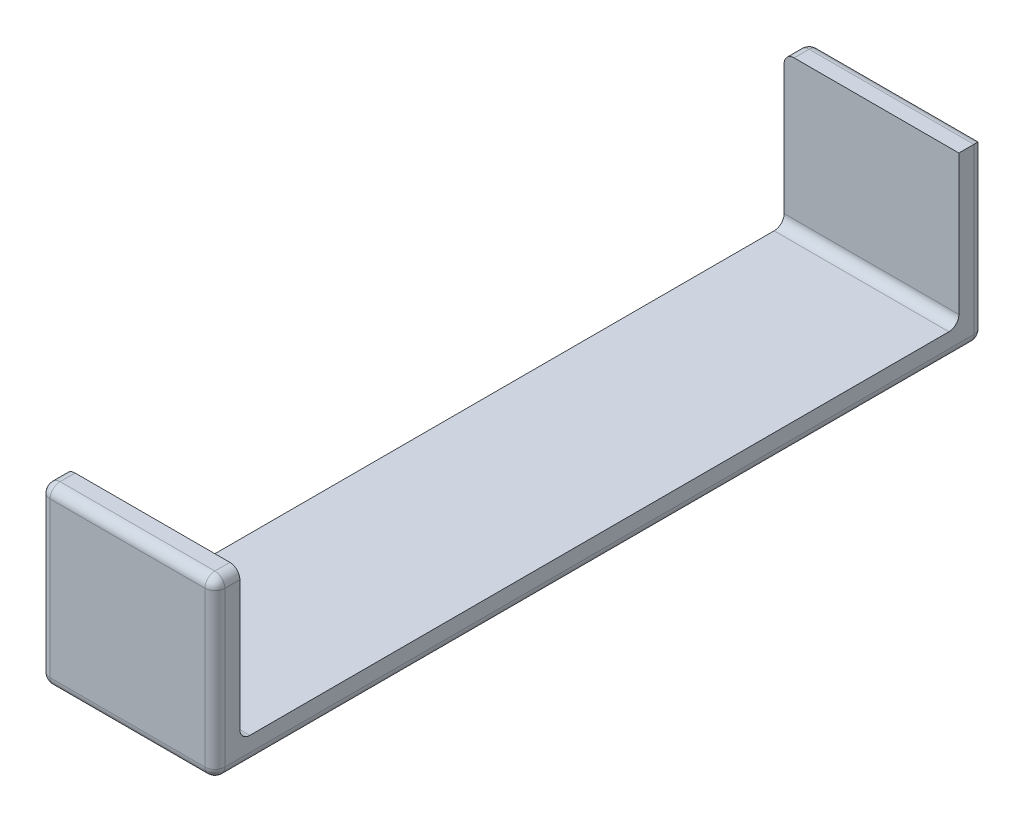
ISO-10303-21;
HEADER;
FILE_DESCRIPTION(('STEP AP214'),'2;1');
FILE_NAME('part.step','',(''),(''),'','','');
FILE_SCHEMA(('AUTOMOTIVE_DESIGN { 1 0 10303 214 1 1 1 1 }'));
ENDSEC;
DATA;
#1=APPLICATION_CONTEXT('core data for automotive mechanical design processes');
#2=APPLICATION_PROTOCOL_DEFINITION('international standard','automotive_design',2000,#1);
#3=PRODUCT_CONTEXT('',#1,'mechanical');
#4=PRODUCT('Part','Part','',(#3));
#5=PRODUCT_RELATED_PRODUCT_CATEGORY('part','',(#4));
#6=PRODUCT_DEFINITION_FORMATION('','',#4);
#7=PRODUCT_DEFINITION_CONTEXT('part definition',#1,'design');
#8=PRODUCT_DEFINITION('design','',#6,#7);
#9=PRODUCT_DEFINITION_SHAPE('','',#8);
#10=(LENGTH_UNIT() NAMED_UNIT(*) SI_UNIT(.MILLI.,.METRE.));
#11=(NAMED_UNIT(*) PLANE_ANGLE_UNIT() SI_UNIT($,.RADIAN.));
#12=(NAMED_UNIT(*) SI_UNIT($,.STERADIAN.) SOLID_ANGLE_UNIT());
#13=UNCERTAINTY_MEASURE_WITH_UNIT(LENGTH_MEASURE(1.E-05),#10,'distance_accuracy_value','');
#14=(GEOMETRIC_REPRESENTATION_CONTEXT(3) GLOBAL_UNCERTAINTY_ASSIGNED_CONTEXT((#13)) GLOBAL_UNIT_ASSIGNED_CONTEXT((#10,
#11,#12)) REPRESENTATION_CONTEXT('',''));
#15=CARTESIAN_POINT('',(0.,0.,0.));
#16=DIRECTION('',(0.,0.,1.));
#17=DIRECTION('',(1.,0.,0.));
#18=AXIS2_PLACEMENT_3D('',#15,#16,#17);
#19=CARTESIAN_POINT('',(0.,17.5,77.));
#20=DIRECTION('',(0.,1.,0.));
#21=DIRECTION('',(0.,0.,1.));
#22=AXIS2_PLACEMENT_3D('',#19,#20,#21);
#23=PLANE('',#22);
#24=DIRECTION('',(1.,0.,0.));
#25=VECTOR('',#24,1.);
#26=CARTESIAN_POINT('',(0.,17.5,1.));
#27=LINE('',#26,#25);
#28=CARTESIAN_POINT('',(17.5,17.5,1.));
#29=VERTEX_POINT('',#28);
#30=CARTESIAN_POINT('',(1.,17.5,1.));
#31=VERTEX_POINT('',#30);
#32=EDGE_CURVE('E226',#29,#31,#27,.F.);
#33=ORIENTED_EDGE('',*,*,#32,.T.);
#34=DIRECTION('',(0.,0.,-1.));
#35=VECTOR('',#34,1.);
#36=CARTESIAN_POINT('',(1.,17.5,77.));
#37=LINE('',#36,#35);
#38=CARTESIAN_POINT('',(1.,17.5,2.5));
#39=VERTEX_POINT('',#38);
#40=EDGE_CURVE('E183',#31,#39,#37,.F.);
#41=ORIENTED_EDGE('',*,*,#40,.T.);
#42=DIRECTION('',(-1.,0.,0.));
#43=VECTOR('',#42,1.);
#44=CARTESIAN_POINT('',(0.,17.5,2.5));
#45=LINE('',#44,#43);
#46=CARTESIAN_POINT('',(17.5,17.5,2.5));
#47=VERTEX_POINT('',#46);
#48=EDGE_CURVE('E167',#47,#39,#45,.T.);
#49=ORIENTED_EDGE('',*,*,#48,.F.);
#50=DIRECTION('',(0.,0.,-1.));
#51=VECTOR('',#50,1.);
#52=CARTESIAN_POINT('',(17.5,17.5,77.));
#53=LINE('',#52,#51);
#54=EDGE_CURVE('E180',#47,#29,#53,.T.);
#55=ORIENTED_EDGE('',*,*,#54,.T.);
#56=EDGE_LOOP('',(#33,#41,#49,#55));
#57=FACE_BOUND('',#56,.T.);
#58=ADVANCED_FACE('F33',(#57),#23,.T.);
#59=CARTESIAN_POINT('',(17.5,0.,77.));
#60=DIRECTION('',(0.,-1.,0.));
#61=DIRECTION('',(0.,0.,-1.));
#62=AXIS2_PLACEMENT_3D('',#59,#60,#61);
#63=PLANE('',#62);
#64=DIRECTION('',(-1.,0.,0.));
#65=VECTOR('',#64,1.);
#66=CARTESIAN_POINT('',(0.,0.,76.));
#67=LINE('',#66,#65);
#68=CARTESIAN_POINT('',(16.5,0.,76.));
#69=VERTEX_POINT('',#68);
#70=CARTESIAN_POINT('',(1.,0.,76.));
#71=VERTEX_POINT('',#70);
#72=EDGE_CURVE('E50',#69,#71,#67,.T.);
#73=ORIENTED_EDGE('',*,*,#72,.T.);
#74=DIRECTION('',(0.,0.,-1.));
#75=VECTOR('',#74,1.);
#76=CARTESIAN_POINT('',(1.,0.,77.));
#77=LINE('',#76,#75);
#78=CARTESIAN_POINT('',(1.,0.,1.));
#79=VERTEX_POINT('',#78);
#80=EDGE_CURVE('E254',#71,#79,#77,.T.);
#81=ORIENTED_EDGE('',*,*,#80,.T.);
#82=DIRECTION('',(-1.,0.,0.));
#83=VECTOR('',#82,1.);
#84=CARTESIAN_POINT('',(17.5,0.,1.));
#85=LINE('',#84,#83);
#86=CARTESIAN_POINT('',(16.5,0.,1.));
#87=VERTEX_POINT('',#86);
#88=EDGE_CURVE('E250',#79,#87,#85,.F.);
#89=ORIENTED_EDGE('',*,*,#88,.T.);
#90=DIRECTION('',(0.,0.,-1.));
#91=VECTOR('',#90,1.);
#92=CARTESIAN_POINT('',(16.5,0.,77.));
#93=LINE('',#92,#91);
#94=EDGE_CURVE('E55',#87,#69,#93,.F.);
#95=ORIENTED_EDGE('',*,*,#94,.T.);
#96=EDGE_LOOP('',(#73,#81,#89,#95));
#97=FACE_BOUND('',#96,.T.);
#98=ADVANCED_FACE('F406',(#97),#63,.T.);
#99=CARTESIAN_POINT('',(17.5,17.5,77.));
#100=DIRECTION('',(1.,0.,0.));
#101=DIRECTION('',(0.,1.,0.));
#102=AXIS2_PLACEMENT_3D('',#99,#100,#101);
#103=PLANE('',#102);
#104=DIRECTION('',(0.,1.,0.));
#105=VECTOR('',#104,1.);
#106=CARTESIAN_POINT('',(17.5,22.5,74.5));
#107=LINE('',#106,#105);
#108=CARTESIAN_POINT('',(17.5,3.5,74.5));
#109=VERTEX_POINT('',#108);
#110=CARTESIAN_POINT('',(17.5,16.5,74.5));
#111=VERTEX_POINT('',#110);
#112=EDGE_CURVE('E344',#109,#111,#107,.T.);
#113=ORIENTED_EDGE('',*,*,#112,.T.);
#114=DIRECTION('',(0.,0.,-1.));
#115=VECTOR('',#114,1.);
#116=CARTESIAN_POINT('',(17.5,16.5,77.));
#117=LINE('',#116,#115);
#118=CARTESIAN_POINT('',(17.5,16.5,76.));
#119=VERTEX_POINT('',#118);
#120=EDGE_CURVE('E214',#111,#119,#117,.F.);
#121=ORIENTED_EDGE('',*,*,#120,.T.);
#122=DIRECTION('',(0.,-1.,0.));
#123=VECTOR('',#122,1.);
#124=CARTESIAN_POINT('',(17.5,0.,76.));
#125=LINE('',#124,#123);
#126=CARTESIAN_POINT('',(17.5,1.,76.));
#127=VERTEX_POINT('',#126);
#128=EDGE_CURVE('E212',#119,#127,#125,.T.);
#129=ORIENTED_EDGE('',*,*,#128,.T.);
#130=DIRECTION('',(0.,0.,-1.));
#131=VECTOR('',#130,1.);
#132=CARTESIAN_POINT('',(17.5,1.,77.));
#133=LINE('',#132,#131);
#134=CARTESIAN_POINT('',(17.5,1.,1.));
#135=VERTEX_POINT('',#134);
#136=EDGE_CURVE('E210',#127,#135,#133,.T.);
#137=ORIENTED_EDGE('',*,*,#136,.T.);
#138=DIRECTION('',(0.,-1.,0.));
#139=VECTOR('',#138,1.);
#140=CARTESIAN_POINT('',(17.5,17.5,1.));
#141=LINE('',#140,#139);
#142=EDGE_CURVE('E189',#135,#29,#141,.F.);
#143=ORIENTED_EDGE('',*,*,#142,.T.);
#144=ORIENTED_EDGE('',*,*,#54,.F.);
#145=DIRECTION('',(0.,-1.,0.));
#146=VECTOR('',#145,1.);
#147=CARTESIAN_POINT('',(17.5,22.5,2.5));
#148=LINE('',#147,#146);
#149=CARTESIAN_POINT('',(17.5,3.5,2.5));
#150=VERTEX_POINT('',#149);
#151=EDGE_CURVE('E164',#47,#150,#148,.T.);
#152=ORIENTED_EDGE('',*,*,#151,.T.);
#153=CARTESIAN_POINT('',(17.5,3.5,3.5));
#154=DIRECTION('',(1.,0.,0.));
#155=DIRECTION('',(0.,1.,0.));
#156=AXIS2_PLACEMENT_3D('',#153,#154,#155);
#157=CIRCLE('',#156,1.);
#158=CARTESIAN_POINT('',(17.5,2.5,3.5));
#159=VERTEX_POINT('',#158);
#160=EDGE_CURVE('E11',#150,#159,#157,.F.);
#161=ORIENTED_EDGE('',*,*,#160,.T.);
#162=DIRECTION('',(0.,0.,1.));
#163=VECTOR('',#162,1.);
#164=CARTESIAN_POINT('',(17.5,2.5,2.5));
#165=LINE('',#164,#163);
#166=CARTESIAN_POINT('',(17.5,2.5,73.5));
#167=VERTEX_POINT('',#166);
#168=EDGE_CURVE('E175',#159,#167,#165,.T.);
#169=ORIENTED_EDGE('',*,*,#168,.T.);
#170=CARTESIAN_POINT('',(17.5,3.5,73.5));
#171=DIRECTION('',(1.,0.,0.));
#172=DIRECTION('',(0.,1.,0.));
#173=AXIS2_PLACEMENT_3D('',#170,#171,#172);
#174=CIRCLE('',#173,1.);
#175=EDGE_CURVE('E263',#167,#109,#174,.F.);
#176=ORIENTED_EDGE('',*,*,#175,.T.);
#177=EDGE_LOOP('',(#113,#121,#129,#137,#143,#144,#152,#161,#169,#176));
#178=FACE_BOUND('',#177,.T.);
#179=ADVANCED_FACE('F187',(#178),#103,.T.);
#180=DIRECTION('',(1.,0.,0.));
#181=VECTOR('',#180,1.);
#182=CARTESIAN_POINT('',(17.5,17.5,76.));
#183=LINE('',#182,#181);
#184=CARTESIAN_POINT('',(1.,17.5,76.));
#185=VERTEX_POINT('',#184);
#186=CARTESIAN_POINT('',(16.5,17.5,76.));
#187=VERTEX_POINT('',#186);
#188=EDGE_CURVE('E192',#185,#187,#183,.T.);
#189=ORIENTED_EDGE('',*,*,#188,.T.);
#190=DIRECTION('',(0.,0.,-1.));
#191=VECTOR('',#190,1.);
#192=CARTESIAN_POINT('',(16.5,17.5,77.));
#193=LINE('',#192,#191);
#194=CARTESIAN_POINT('',(16.5,17.5,74.5));
#195=VERTEX_POINT('',#194);
#196=EDGE_CURVE('E199',#187,#195,#193,.T.);
#197=ORIENTED_EDGE('',*,*,#196,.T.);
#198=DIRECTION('',(1.,0.,0.));
#199=VECTOR('',#198,1.);
#200=CARTESIAN_POINT('',(0.,17.5,74.5));
#201=LINE('',#200,#199);
#202=CARTESIAN_POINT('',(1.,17.5,74.5));
#203=VERTEX_POINT('',#202);
#204=EDGE_CURVE('E184',#203,#195,#201,.T.);
#205=ORIENTED_EDGE('',*,*,#204,.F.);
#206=DIRECTION('',(0.,0.,-1.));
#207=VECTOR('',#206,1.);
#208=CARTESIAN_POINT('',(1.,17.5,77.));
#209=LINE('',#208,#207);
#210=EDGE_CURVE('E197',#203,#185,#209,.F.);
#211=ORIENTED_EDGE('',*,*,#210,.T.);
#212=EDGE_LOOP('',(#189,#197,#205,#211));
#213=FACE_BOUND('',#212,.T.);
#214=ADVANCED_FACE('F384',(#213),#23,.T.);
#215=CARTESIAN_POINT('',(0.,0.,77.));
#216=DIRECTION('',(-1.,0.,0.));
#217=DIRECTION('',(0.,0.,1.));
#218=AXIS2_PLACEMENT_3D('',#215,#216,#217);
#219=PLANE('',#218);
#220=DIRECTION('',(0.,-1.,0.));
#221=VECTOR('',#220,1.);
#222=CARTESIAN_POINT('',(0.,0.,2.5));
#223=LINE('',#222,#221);
#224=CARTESIAN_POINT('',(0.,16.5,2.5));
#225=VERTEX_POINT('',#224);
#226=CARTESIAN_POINT('',(0.,3.5,2.5));
#227=VERTEX_POINT('',#226);
#228=EDGE_CURVE('E190',#225,#227,#223,.T.);
#229=ORIENTED_EDGE('',*,*,#228,.F.);
#230=DIRECTION('',(0.,0.,-1.));
#231=VECTOR('',#230,1.);
#232=CARTESIAN_POINT('',(0.,16.5,77.));
#233=LINE('',#232,#231);
#234=CARTESIAN_POINT('',(0.,16.5,1.));
#235=VERTEX_POINT('',#234);
#236=EDGE_CURVE('E224',#225,#235,#233,.T.);
#237=ORIENTED_EDGE('',*,*,#236,.T.);
#238=DIRECTION('',(0.,1.,0.));
#239=VECTOR('',#238,1.);
#240=CARTESIAN_POINT('',(0.,0.,1.));
#241=LINE('',#240,#239);
#242=CARTESIAN_POINT('',(0.,1.,1.));
#243=VERTEX_POINT('',#242);
#244=EDGE_CURVE('E218',#235,#243,#241,.F.);
#245=ORIENTED_EDGE('',*,*,#244,.T.);
#246=DIRECTION('',(0.,0.,-1.));
#247=VECTOR('',#246,1.);
#248=CARTESIAN_POINT('',(0.,1.,77.));
#249=LINE('',#248,#247);
#250=CARTESIAN_POINT('',(0.,1.,76.));
#251=VERTEX_POINT('',#250);
#252=EDGE_CURVE('E216',#243,#251,#249,.F.);
#253=ORIENTED_EDGE('',*,*,#252,.T.);
#254=DIRECTION('',(0.,1.,0.));
#255=VECTOR('',#254,1.);
#256=CARTESIAN_POINT('',(0.,17.5,76.));
#257=LINE('',#256,#255);
#258=CARTESIAN_POINT('',(0.,16.5,76.));
#259=VERTEX_POINT('',#258);
#260=EDGE_CURVE('E220',#251,#259,#257,.T.);
#261=ORIENTED_EDGE('',*,*,#260,.T.);
#262=DIRECTION('',(0.,0.,-1.));
#263=VECTOR('',#262,1.);
#264=CARTESIAN_POINT('',(0.,16.5,77.));
#265=LINE('',#264,#263);
#266=CARTESIAN_POINT('',(0.,16.5,74.5));
#267=VERTEX_POINT('',#266);
#268=EDGE_CURVE('E222',#259,#267,#265,.T.);
#269=ORIENTED_EDGE('',*,*,#268,.T.);
#270=DIRECTION('',(0.,1.,0.));
#271=VECTOR('',#270,1.);
#272=CARTESIAN_POINT('',(0.,22.5,74.5));
#273=LINE('',#272,#271);
#274=CARTESIAN_POINT('',(0.,3.5,74.5));
#275=VERTEX_POINT('',#274);
#276=EDGE_CURVE('E176',#275,#267,#273,.T.);
#277=ORIENTED_EDGE('',*,*,#276,.F.);
#278=CARTESIAN_POINT('',(0.,3.5,73.5));
#279=DIRECTION('',(-1.,0.,0.));
#280=DIRECTION('',(0.,0.,1.));
#281=AXIS2_PLACEMENT_3D('',#278,#279,#280);
#282=CIRCLE('',#281,1.);
#283=CARTESIAN_POINT('',(0.,2.5,73.5));
#284=VERTEX_POINT('',#283);
#285=EDGE_CURVE('E261',#275,#284,#282,.F.);
#286=ORIENTED_EDGE('',*,*,#285,.T.);
#287=DIRECTION('',(0.,0.,1.));
#288=VECTOR('',#287,1.);
#289=CARTESIAN_POINT('',(0.,2.5,2.5));
#290=LINE('',#289,#288);
#291=CARTESIAN_POINT('',(0.,2.5,3.5));
#292=VERTEX_POINT('',#291);
#293=EDGE_CURVE('E333',#292,#284,#290,.T.);
#294=ORIENTED_EDGE('',*,*,#293,.F.);
#295=CARTESIAN_POINT('',(0.,3.5,3.5));
#296=DIRECTION('',(-1.,0.,0.));
#297=DIRECTION('',(0.,0.,1.));
#298=AXIS2_PLACEMENT_3D('',#295,#296,#297);
#299=CIRCLE('',#298,1.);
#300=EDGE_CURVE('E42',#292,#227,#299,.F.);
#301=ORIENTED_EDGE('',*,*,#300,.T.);
#302=EDGE_LOOP('',(#229,#237,#245,#253,#261,#269,#277,#286,#294,#301));
#303=FACE_BOUND('',#302,.T.);
#304=ADVANCED_FACE('F363',(#303),#219,.T.);
#305=CARTESIAN_POINT('',(0.,0.,77.));
#306=DIRECTION('',(0.,0.,-1.));
#307=DIRECTION('',(-1.,0.,0.));
#308=AXIS2_PLACEMENT_3D('',#305,#306,#307);
#309=PLANE('',#308);
#310=DIRECTION('',(1.,0.,0.));
#311=VECTOR('',#310,1.);
#312=CARTESIAN_POINT('',(0.,16.5,77.));
#313=LINE('',#312,#311);
#314=CARTESIAN_POINT('',(16.5,16.5,77.));
#315=VERTEX_POINT('',#314);
#316=CARTESIAN_POINT('',(1.,16.5,77.));
#317=VERTEX_POINT('',#316);
#318=EDGE_CURVE('E236',#315,#317,#313,.F.);
#319=ORIENTED_EDGE('',*,*,#318,.T.);
#320=DIRECTION('',(0.,1.,0.));
#321=VECTOR('',#320,1.);
#322=CARTESIAN_POINT('',(1.,0.,77.));
#323=LINE('',#322,#321);
#324=CARTESIAN_POINT('',(1.,1.,77.));
#325=VERTEX_POINT('',#324);
#326=EDGE_CURVE('E238',#317,#325,#323,.F.);
#327=ORIENTED_EDGE('',*,*,#326,.T.);
#328=DIRECTION('',(-1.,0.,0.));
#329=VECTOR('',#328,1.);
#330=CARTESIAN_POINT('',(17.5,1.,77.));
#331=LINE('',#330,#329);
#332=CARTESIAN_POINT('',(16.5,1.,77.));
#333=VERTEX_POINT('',#332);
#334=EDGE_CURVE('E232',#325,#333,#331,.F.);
#335=ORIENTED_EDGE('',*,*,#334,.T.);
#336=DIRECTION('',(0.,-1.,0.));
#337=VECTOR('',#336,1.);
#338=CARTESIAN_POINT('',(16.5,17.5,77.));
#339=LINE('',#338,#337);
#340=EDGE_CURVE('E234',#333,#315,#339,.F.);
#341=ORIENTED_EDGE('',*,*,#340,.T.);
#342=EDGE_LOOP('',(#319,#327,#335,#341));
#343=FACE_BOUND('',#342,.T.);
#344=ADVANCED_FACE('F419',(#343),#309,.F.);
#345=CARTESIAN_POINT('',(0.,0.,0.));
#346=DIRECTION('',(0.,0.,-1.));
#347=DIRECTION('',(-1.,0.,0.));
#348=AXIS2_PLACEMENT_3D('',#345,#346,#347);
#349=PLANE('',#348);
#350=DIRECTION('',(0.,1.,0.));
#351=VECTOR('',#350,1.);
#352=CARTESIAN_POINT('',(1.,0.,0.));
#353=LINE('',#352,#351);
#354=CARTESIAN_POINT('',(1.,1.,0.));
#355=VERTEX_POINT('',#354);
#356=CARTESIAN_POINT('',(1.,16.5,0.));
#357=VERTEX_POINT('',#356);
#358=EDGE_CURVE('E245',#355,#357,#353,.T.);
#359=ORIENTED_EDGE('',*,*,#358,.T.);
#360=DIRECTION('',(1.,0.,0.));
#361=VECTOR('',#360,1.);
#362=CARTESIAN_POINT('',(0.,16.5,0.));
#363=LINE('',#362,#361);
#364=CARTESIAN_POINT('',(16.5,16.5,0.));
#365=VERTEX_POINT('',#364);
#366=EDGE_CURVE('E247',#357,#365,#363,.T.);
#367=ORIENTED_EDGE('',*,*,#366,.T.);
#368=DIRECTION('',(0.,-1.,0.));
#369=VECTOR('',#368,1.);
#370=CARTESIAN_POINT('',(16.5,0.,0.));
#371=LINE('',#370,#369);
#372=CARTESIAN_POINT('',(16.5,1.,0.));
#373=VERTEX_POINT('',#372);
#374=EDGE_CURVE('E243',#365,#373,#371,.T.);
#375=ORIENTED_EDGE('',*,*,#374,.T.);
#376=DIRECTION('',(-1.,0.,0.));
#377=VECTOR('',#376,1.);
#378=CARTESIAN_POINT('',(0.,1.,0.));
#379=LINE('',#378,#377);
#380=EDGE_CURVE('E241',#373,#355,#379,.T.);
#381=ORIENTED_EDGE('',*,*,#380,.T.);
#382=EDGE_LOOP('',(#359,#367,#375,#381));
#383=FACE_BOUND('',#382,.T.);
#384=ADVANCED_FACE('F423',(#383),#349,.T.);
#385=CARTESIAN_POINT('',(17.5,22.5,2.5));
#386=DIRECTION('',(0.,0.,-1.));
#387=DIRECTION('',(-1.,0.,0.));
#388=AXIS2_PLACEMENT_3D('',#385,#386,#387);
#389=PLANE('',#388);
#390=ORIENTED_EDGE('',*,*,#48,.T.);
#391=CARTESIAN_POINT('',(1.,16.5,2.5));
#392=DIRECTION('',(0.,0.,-1.));
#393=DIRECTION('',(-1.,0.,0.));
#394=AXIS2_PLACEMENT_3D('',#391,#392,#393);
#395=CIRCLE('',#394,1.);
#396=EDGE_CURVE('E230',#39,#225,#395,.F.);
#397=ORIENTED_EDGE('',*,*,#396,.T.);
#398=ORIENTED_EDGE('',*,*,#228,.T.);
#399=DIRECTION('',(-1.,0.,0.));
#400=VECTOR('',#399,1.);
#401=CARTESIAN_POINT('',(17.5,3.5,2.5));
#402=LINE('',#401,#400);
#403=EDGE_CURVE('E171',#227,#150,#402,.F.);
#404=ORIENTED_EDGE('',*,*,#403,.T.);
#405=ORIENTED_EDGE('',*,*,#151,.F.);
#406=EDGE_LOOP('',(#390,#397,#398,#404,#405));
#407=FACE_BOUND('',#406,.T.);
#408=ADVANCED_FACE('F166',(#407),#389,.F.);
#409=CARTESIAN_POINT('',(17.5,22.5,74.5));
#410=DIRECTION('',(0.,0.,1.));
#411=DIRECTION('',(1.,0.,0.));
#412=AXIS2_PLACEMENT_3D('',#409,#410,#411);
#413=PLANE('',#412);
#414=ORIENTED_EDGE('',*,*,#204,.T.);
#415=CARTESIAN_POINT('',(16.5,16.5,74.5));
#416=DIRECTION('',(0.,0.,1.));
#417=DIRECTION('',(1.,0.,0.));
#418=AXIS2_PLACEMENT_3D('',#415,#416,#417);
#419=CIRCLE('',#418,1.);
#420=EDGE_CURVE('E207',#195,#111,#419,.F.);
#421=ORIENTED_EDGE('',*,*,#420,.T.);
#422=ORIENTED_EDGE('',*,*,#112,.F.);
#423=DIRECTION('',(-1.,0.,0.));
#424=VECTOR('',#423,1.);
#425=CARTESIAN_POINT('',(0.,3.5,74.5));
#426=LINE('',#425,#424);
#427=EDGE_CURVE('E202',#109,#275,#426,.T.);
#428=ORIENTED_EDGE('',*,*,#427,.T.);
#429=ORIENTED_EDGE('',*,*,#276,.T.);
#430=CARTESIAN_POINT('',(1.,16.5,74.5));
#431=DIRECTION('',(0.,0.,1.));
#432=DIRECTION('',(1.,0.,0.));
#433=AXIS2_PLACEMENT_3D('',#430,#431,#432);
#434=CIRCLE('',#433,1.);
#435=EDGE_CURVE('E205',#267,#203,#434,.F.);
#436=ORIENTED_EDGE('',*,*,#435,.T.);
#437=EDGE_LOOP('',(#414,#421,#422,#428,#429,#436));
#438=FACE_BOUND('',#437,.T.);
#439=ADVANCED_FACE('F359',(#438),#413,.F.);
#440=CARTESIAN_POINT('',(17.5,2.5,2.5));
#441=DIRECTION('',(0.,-1.,0.));
#442=DIRECTION('',(0.,0.,-1.));
#443=AXIS2_PLACEMENT_3D('',#440,#441,#442);
#444=PLANE('',#443);
#445=ORIENTED_EDGE('',*,*,#293,.T.);
#446=DIRECTION('',(-1.,0.,0.));
#447=VECTOR('',#446,1.);
#448=CARTESIAN_POINT('',(17.5,2.5,73.5));
#449=LINE('',#448,#447);
#450=EDGE_CURVE('E259',#284,#167,#449,.F.);
#451=ORIENTED_EDGE('',*,*,#450,.T.);
#452=ORIENTED_EDGE('',*,*,#168,.F.);
#453=DIRECTION('',(-1.,0.,0.));
#454=VECTOR('',#453,1.);
#455=CARTESIAN_POINT('',(0.,2.5,3.5));
#456=LINE('',#455,#454);
#457=EDGE_CURVE('E256',#159,#292,#456,.T.);
#458=ORIENTED_EDGE('',*,*,#457,.T.);
#459=EDGE_LOOP('',(#445,#451,#452,#458));
#460=FACE_BOUND('',#459,.T.);
#461=ADVANCED_FACE('F432',(#460),#444,.F.);
#462=CARTESIAN_POINT('',(1.,16.5,77.));
#463=DIRECTION('',(0.,0.,-1.));
#464=DIRECTION('',(-1.,0.,0.));
#465=AXIS2_PLACEMENT_3D('',#462,#463,#464);
#466=CYLINDRICAL_SURFACE('',#465,1.);
#467=CARTESIAN_POINT('',(1.,16.5,1.));
#468=DIRECTION('',(0.,0.,-1.));
#469=DIRECTION('',(-1.,0.,0.));
#470=AXIS2_PLACEMENT_3D('',#467,#468,#469);
#471=CIRCLE('',#470,1.);
#472=EDGE_CURVE('E37',#235,#31,#471,.T.);
#473=ORIENTED_EDGE('',*,*,#472,.F.);
#474=ORIENTED_EDGE('',*,*,#236,.F.);
#475=ORIENTED_EDGE('',*,*,#396,.F.);
#476=ORIENTED_EDGE('',*,*,#40,.F.);
#477=EDGE_LOOP('',(#473,#474,#475,#476));
#478=FACE_BOUND('',#477,.T.);
#479=ADVANCED_FACE('F435',(#478),#466,.T.);
#480=CARTESIAN_POINT('',(1.,16.5,1.));
#481=DIRECTION('',(0.,0.,1.));
#482=DIRECTION('',(1.,0.,0.));
#483=AXIS2_PLACEMENT_3D('',#480,#481,#482);
#484=SPHERICAL_SURFACE('',#483,1.);
#485=CARTESIAN_POINT('',(1.,16.5,1.));
#486=DIRECTION('',(-1.,0.,0.));
#487=DIRECTION('',(0.,0.,1.));
#488=AXIS2_PLACEMENT_3D('',#485,#486,#487);
#489=CIRCLE('',#488,1.);
#490=EDGE_CURVE('E323',#357,#31,#489,.F.);
#491=ORIENTED_EDGE('',*,*,#490,.F.);
#492=CARTESIAN_POINT('',(1.,16.5,1.));
#493=DIRECTION('',(0.,1.,0.));
#494=DIRECTION('',(0.,0.,1.));
#495=AXIS2_PLACEMENT_3D('',#492,#493,#494);
#496=CIRCLE('',#495,1.);
#497=EDGE_CURVE('E325',#235,#357,#496,.F.);
#498=ORIENTED_EDGE('',*,*,#497,.F.);
#499=ORIENTED_EDGE('',*,*,#472,.T.);
#500=EDGE_LOOP('',(#491,#498,#499));
#501=FACE_BOUND('',#500,.T.);
#502=ADVANCED_FACE('F451',(#501),#484,.T.);
#503=CARTESIAN_POINT('',(1.,0.,1.));
#504=DIRECTION('',(0.,1.,0.));
#505=DIRECTION('',(0.,0.,1.));
#506=AXIS2_PLACEMENT_3D('',#503,#504,#505);
#507=CYLINDRICAL_SURFACE('',#506,1.);
#508=ORIENTED_EDGE('',*,*,#497,.T.);
#509=ORIENTED_EDGE('',*,*,#358,.F.);
#510=CARTESIAN_POINT('',(1.,1.,1.));
#511=DIRECTION('',(0.,-1.,0.));
#512=DIRECTION('',(0.,0.,-1.));
#513=AXIS2_PLACEMENT_3D('',#510,#511,#512);
#514=CIRCLE('',#513,1.);
#515=EDGE_CURVE('E320',#243,#355,#514,.T.);
#516=ORIENTED_EDGE('',*,*,#515,.F.);
#517=ORIENTED_EDGE('',*,*,#244,.F.);
#518=EDGE_LOOP('',(#508,#509,#516,#517));
#519=FACE_BOUND('',#518,.T.);
#520=ADVANCED_FACE('F459',(#519),#507,.T.);
#521=CARTESIAN_POINT('',(0.,16.5,1.));
#522=DIRECTION('',(1.,0.,0.));
#523=DIRECTION('',(0.,0.,-1.));
#524=AXIS2_PLACEMENT_3D('',#521,#522,#523);
#525=CYLINDRICAL_SURFACE('',#524,1.);
#526=ORIENTED_EDGE('',*,*,#490,.T.);
#527=ORIENTED_EDGE('',*,*,#32,.F.);
#528=CARTESIAN_POINT('',(16.5,16.5,1.));
#529=DIRECTION('',(0.707106781186548,-0.707106781186547,0.));
#530=DIRECTION('',(-0.707106781186547,-0.707106781186548,0.));
#531=AXIS2_PLACEMENT_3D('',#528,#529,#530);
#532=ELLIPSE('',#531,1.41421356237309,1.);
#533=EDGE_CURVE('E317',#365,#29,#532,.T.);
#534=ORIENTED_EDGE('',*,*,#533,.F.);
#535=ORIENTED_EDGE('',*,*,#366,.F.);
#536=EDGE_LOOP('',(#526,#527,#534,#535));
#537=FACE_BOUND('',#536,.T.);
#538=ADVANCED_FACE('F466',(#537),#525,.T.);
#539=CARTESIAN_POINT('',(1.,1.,1.));
#540=DIRECTION('',(0.,0.,1.));
#541=DIRECTION('',(1.,0.,0.));
#542=AXIS2_PLACEMENT_3D('',#539,#540,#541);
#543=SPHERICAL_SURFACE('',#542,1.);
#544=CARTESIAN_POINT('',(1.,1.,1.));
#545=DIRECTION('',(0.,0.,-1.));
#546=DIRECTION('',(-1.,0.,0.));
#547=AXIS2_PLACEMENT_3D('',#544,#545,#546);
#548=CIRCLE('',#547,1.);
#549=EDGE_CURVE('E311',#243,#79,#548,.F.);
#550=ORIENTED_EDGE('',*,*,#549,.F.);
#551=ORIENTED_EDGE('',*,*,#515,.T.);
#552=CARTESIAN_POINT('',(1.,1.,1.));
#553=DIRECTION('',(-1.,0.,0.));
#554=DIRECTION('',(0.,-1.,0.));
#555=AXIS2_PLACEMENT_3D('',#552,#553,#554);
#556=CIRCLE('',#555,1.);
#557=EDGE_CURVE('E314',#79,#355,#556,.F.);
#558=ORIENTED_EDGE('',*,*,#557,.F.);
#559=EDGE_LOOP('',(#550,#551,#558));
#560=FACE_BOUND('',#559,.T.);
#561=ADVANCED_FACE('F473',(#560),#543,.T.);
#562=CARTESIAN_POINT('',(16.5,0.,1.));
#563=DIRECTION('',(0.,-1.,0.));
#564=DIRECTION('',(1.,0.,0.));
#565=AXIS2_PLACEMENT_3D('',#562,#563,#564);
#566=CYLINDRICAL_SURFACE('',#565,1.);
#567=ORIENTED_EDGE('',*,*,#533,.T.);
#568=ORIENTED_EDGE('',*,*,#142,.F.);
#569=CARTESIAN_POINT('',(16.5,1.,1.));
#570=DIRECTION('',(0.,-1.,0.));
#571=DIRECTION('',(1.,0.,0.));
#572=AXIS2_PLACEMENT_3D('',#569,#570,#571);
#573=CIRCLE('',#572,1.);
#574=EDGE_CURVE('E308',#373,#135,#573,.T.);
#575=ORIENTED_EDGE('',*,*,#574,.F.);
#576=ORIENTED_EDGE('',*,*,#374,.F.);
#577=EDGE_LOOP('',(#567,#568,#575,#576));
#578=FACE_BOUND('',#577,.T.);
#579=ADVANCED_FACE('F481',(#578),#566,.T.);
#580=CARTESIAN_POINT('',(0.,1.,1.));
#581=DIRECTION('',(-1.,0.,0.));
#582=DIRECTION('',(0.,0.,1.));
#583=AXIS2_PLACEMENT_3D('',#580,#581,#582);
#584=CYLINDRICAL_SURFACE('',#583,1.);
#585=ORIENTED_EDGE('',*,*,#557,.T.);
#586=ORIENTED_EDGE('',*,*,#380,.F.);
#587=CARTESIAN_POINT('',(16.5,1.,1.));
#588=DIRECTION('',(1.,0.,0.));
#589=DIRECTION('',(0.,0.,-1.));
#590=AXIS2_PLACEMENT_3D('',#587,#588,#589);
#591=CIRCLE('',#590,1.);
#592=EDGE_CURVE('E305',#87,#373,#591,.T.);
#593=ORIENTED_EDGE('',*,*,#592,.F.);
#594=ORIENTED_EDGE('',*,*,#88,.F.);
#595=EDGE_LOOP('',(#585,#586,#593,#594));
#596=FACE_BOUND('',#595,.T.);
#597=ADVANCED_FACE('F489',(#596),#584,.T.);
#598=CARTESIAN_POINT('',(1.,1.,77.));
#599=DIRECTION('',(0.,0.,-1.));
#600=DIRECTION('',(-1.,0.,0.));
#601=AXIS2_PLACEMENT_3D('',#598,#599,#600);
#602=CYLINDRICAL_SURFACE('',#601,1.);
#603=ORIENTED_EDGE('',*,*,#549,.T.);
#604=ORIENTED_EDGE('',*,*,#80,.F.);
#605=CARTESIAN_POINT('',(1.,1.,76.));
#606=DIRECTION('',(0.,0.,1.));
#607=DIRECTION('',(1.,0.,0.));
#608=AXIS2_PLACEMENT_3D('',#605,#606,#607);
#609=CIRCLE('',#608,1.);
#610=EDGE_CURVE('E302',#251,#71,#609,.T.);
#611=ORIENTED_EDGE('',*,*,#610,.F.);
#612=ORIENTED_EDGE('',*,*,#252,.F.);
#613=EDGE_LOOP('',(#603,#604,#611,#612));
#614=FACE_BOUND('',#613,.T.);
#615=ADVANCED_FACE('F497',(#614),#602,.T.);
#616=CARTESIAN_POINT('',(16.5,1.,1.));
#617=DIRECTION('',(0.,0.,1.));
#618=DIRECTION('',(1.,0.,0.));
#619=AXIS2_PLACEMENT_3D('',#616,#617,#618);
#620=SPHERICAL_SURFACE('',#619,1.);
#621=ORIENTED_EDGE('',*,*,#592,.T.);
#622=ORIENTED_EDGE('',*,*,#574,.T.);
#623=CARTESIAN_POINT('',(16.5,1.,1.));
#624=DIRECTION('',(0.,0.,-1.));
#625=DIRECTION('',(-1.,0.,0.));
#626=AXIS2_PLACEMENT_3D('',#623,#624,#625);
#627=CIRCLE('',#626,1.);
#628=EDGE_CURVE('E299',#87,#135,#627,.F.);
#629=ORIENTED_EDGE('',*,*,#628,.F.);
#630=EDGE_LOOP('',(#621,#622,#629));
#631=FACE_BOUND('',#630,.T.);
#632=ADVANCED_FACE('F505',(#631),#620,.T.);
#633=CARTESIAN_POINT('',(1.,1.,76.));
#634=DIRECTION('',(0.,0.,1.));
#635=DIRECTION('',(1.,0.,0.));
#636=AXIS2_PLACEMENT_3D('',#633,#634,#635);
#637=SPHERICAL_SURFACE('',#636,1.);
#638=CARTESIAN_POINT('',(1.,1.,76.));
#639=DIRECTION('',(0.,-1.,0.));
#640=DIRECTION('',(0.,0.,-1.));
#641=AXIS2_PLACEMENT_3D('',#638,#639,#640);
#642=CIRCLE('',#641,1.);
#643=EDGE_CURVE('E293',#251,#325,#642,.F.);
#644=ORIENTED_EDGE('',*,*,#643,.F.);
#645=ORIENTED_EDGE('',*,*,#610,.T.);
#646=CARTESIAN_POINT('',(1.,1.,76.));
#647=DIRECTION('',(-1.,0.,0.));
#648=DIRECTION('',(0.,0.,1.));
#649=AXIS2_PLACEMENT_3D('',#646,#647,#648);
#650=CIRCLE('',#649,1.);
#651=EDGE_CURVE('E296',#325,#71,#650,.F.);
#652=ORIENTED_EDGE('',*,*,#651,.F.);
#653=EDGE_LOOP('',(#644,#645,#652));
#654=FACE_BOUND('',#653,.T.);
#655=ADVANCED_FACE('F513',(#654),#637,.T.);
#656=CARTESIAN_POINT('',(16.5,1.,77.));
#657=DIRECTION('',(0.,0.,-1.));
#658=DIRECTION('',(-1.,0.,0.));
#659=AXIS2_PLACEMENT_3D('',#656,#657,#658);
#660=CYLINDRICAL_SURFACE('',#659,1.);
#661=ORIENTED_EDGE('',*,*,#628,.T.);
#662=ORIENTED_EDGE('',*,*,#136,.F.);
#663=CARTESIAN_POINT('',(16.5,1.,76.));
#664=DIRECTION('',(0.,0.,1.));
#665=DIRECTION('',(1.,0.,0.));
#666=AXIS2_PLACEMENT_3D('',#663,#664,#665);
#667=CIRCLE('',#666,1.);
#668=EDGE_CURVE('E290',#69,#127,#667,.T.);
#669=ORIENTED_EDGE('',*,*,#668,.F.);
#670=ORIENTED_EDGE('',*,*,#94,.F.);
#671=EDGE_LOOP('',(#661,#662,#669,#670));
#672=FACE_BOUND('',#671,.T.);
#673=ADVANCED_FACE('F521',(#672),#660,.T.);
#674=CARTESIAN_POINT('',(17.5,1.,76.));
#675=DIRECTION('',(1.,0.,0.));
#676=DIRECTION('',(0.,0.,-1.));
#677=AXIS2_PLACEMENT_3D('',#674,#675,#676);
#678=CYLINDRICAL_SURFACE('',#677,1.);
#679=ORIENTED_EDGE('',*,*,#651,.T.);
#680=ORIENTED_EDGE('',*,*,#72,.F.);
#681=CARTESIAN_POINT('',(16.5,1.,76.));
#682=DIRECTION('',(1.,0.,0.));
#683=DIRECTION('',(0.,0.,-1.));
#684=AXIS2_PLACEMENT_3D('',#681,#682,#683);
#685=CIRCLE('',#684,1.);
#686=EDGE_CURVE('E287',#333,#69,#685,.T.);
#687=ORIENTED_EDGE('',*,*,#686,.F.);
#688=ORIENTED_EDGE('',*,*,#334,.F.);
#689=EDGE_LOOP('',(#679,#680,#687,#688));
#690=FACE_BOUND('',#689,.T.);
#691=ADVANCED_FACE('F529',(#690),#678,.T.);
#692=CARTESIAN_POINT('',(1.,0.,76.));
#693=DIRECTION('',(0.,-1.,0.));
#694=DIRECTION('',(0.,0.,-1.));
#695=AXIS2_PLACEMENT_3D('',#692,#693,#694);
#696=CYLINDRICAL_SURFACE('',#695,1.);
#697=ORIENTED_EDGE('',*,*,#643,.T.);
#698=ORIENTED_EDGE('',*,*,#326,.F.);
#699=CARTESIAN_POINT('',(1.,16.5,76.));
#700=DIRECTION('',(0.,1.,0.));
#701=DIRECTION('',(0.,0.,1.));
#702=AXIS2_PLACEMENT_3D('',#699,#700,#701);
#703=CIRCLE('',#702,1.);
#704=EDGE_CURVE('E284',#259,#317,#703,.T.);
#705=ORIENTED_EDGE('',*,*,#704,.F.);
#706=ORIENTED_EDGE('',*,*,#260,.F.);
#707=EDGE_LOOP('',(#697,#698,#705,#706));
#708=FACE_BOUND('',#707,.T.);
#709=ADVANCED_FACE('F374',(#708),#696,.T.);
#710=CARTESIAN_POINT('',(1.,16.5,77.));
#711=DIRECTION('',(0.,0.,-1.));
#712=DIRECTION('',(-1.,0.,0.));
#713=AXIS2_PLACEMENT_3D('',#710,#711,#712);
#714=CYLINDRICAL_SURFACE('',#713,1.);
#715=ORIENTED_EDGE('',*,*,#435,.F.);
#716=ORIENTED_EDGE('',*,*,#268,.F.);
#717=CARTESIAN_POINT('',(1.,16.5,76.));
#718=DIRECTION('',(0.,0.,1.));
#719=DIRECTION('',(1.,0.,0.));
#720=AXIS2_PLACEMENT_3D('',#717,#718,#719);
#721=CIRCLE('',#720,1.);
#722=EDGE_CURVE('E281',#185,#259,#721,.T.);
#723=ORIENTED_EDGE('',*,*,#722,.F.);
#724=ORIENTED_EDGE('',*,*,#210,.F.);
#725=EDGE_LOOP('',(#715,#716,#723,#724));
#726=FACE_BOUND('',#725,.T.);
#727=ADVANCED_FACE('F369',(#726),#714,.T.);
#728=CARTESIAN_POINT('',(16.5,1.,76.));
#729=DIRECTION('',(0.,0.,1.));
#730=DIRECTION('',(1.,0.,0.));
#731=AXIS2_PLACEMENT_3D('',#728,#729,#730);
#732=SPHERICAL_SURFACE('',#731,1.);
#733=ORIENTED_EDGE('',*,*,#686,.T.);
#734=ORIENTED_EDGE('',*,*,#668,.T.);
#735=CARTESIAN_POINT('',(16.5,1.,76.));
#736=DIRECTION('',(0.,-1.,0.));
#737=DIRECTION('',(0.,0.,-1.));
#738=AXIS2_PLACEMENT_3D('',#735,#736,#737);
#739=CIRCLE('',#738,1.);
#740=EDGE_CURVE('E278',#333,#127,#739,.F.);
#741=ORIENTED_EDGE('',*,*,#740,.F.);
#742=EDGE_LOOP('',(#733,#734,#741));
#743=FACE_BOUND('',#742,.T.);
#744=ADVANCED_FACE('F550',(#743),#732,.T.);
#745=CARTESIAN_POINT('',(1.,16.5,76.));
#746=DIRECTION('',(0.,0.,1.));
#747=DIRECTION('',(1.,0.,0.));
#748=AXIS2_PLACEMENT_3D('',#745,#746,#747);
#749=SPHERICAL_SURFACE('',#748,1.);
#750=ORIENTED_EDGE('',*,*,#722,.T.);
#751=ORIENTED_EDGE('',*,*,#704,.T.);
#752=CARTESIAN_POINT('',(1.,16.5,76.));
#753=DIRECTION('',(-1.,0.,0.));
#754=DIRECTION('',(0.,0.,1.));
#755=AXIS2_PLACEMENT_3D('',#752,#753,#754);
#756=CIRCLE('',#755,1.);
#757=EDGE_CURVE('E275',#185,#317,#756,.F.);
#758=ORIENTED_EDGE('',*,*,#757,.F.);
#759=EDGE_LOOP('',(#750,#751,#758));
#760=FACE_BOUND('',#759,.T.);
#761=ADVANCED_FACE('F376',(#760),#749,.T.);
#762=CARTESIAN_POINT('',(16.5,17.5,76.));
#763=DIRECTION('',(0.,1.,0.));
#764=DIRECTION('',(-1.,0.,0.));
#765=AXIS2_PLACEMENT_3D('',#762,#763,#764);
#766=CYLINDRICAL_SURFACE('',#765,1.);
#767=ORIENTED_EDGE('',*,*,#740,.T.);
#768=ORIENTED_EDGE('',*,*,#128,.F.);
#769=CARTESIAN_POINT('',(16.5,16.5,76.));
#770=DIRECTION('',(0.,1.,0.));
#771=DIRECTION('',(0.,0.,1.));
#772=AXIS2_PLACEMENT_3D('',#769,#770,#771);
#773=CIRCLE('',#772,1.);
#774=EDGE_CURVE('E272',#315,#119,#773,.T.);
#775=ORIENTED_EDGE('',*,*,#774,.F.);
#776=ORIENTED_EDGE('',*,*,#340,.F.);
#777=EDGE_LOOP('',(#767,#768,#775,#776));
#778=FACE_BOUND('',#777,.T.);
#779=ADVANCED_FACE('F392',(#778),#766,.T.);
#780=CARTESIAN_POINT('',(0.,16.5,76.));
#781=DIRECTION('',(-1.,0.,0.));
#782=DIRECTION('',(0.,0.,1.));
#783=AXIS2_PLACEMENT_3D('',#780,#781,#782);
#784=CYLINDRICAL_SURFACE('',#783,1.);
#785=ORIENTED_EDGE('',*,*,#757,.T.);
#786=ORIENTED_EDGE('',*,*,#318,.F.);
#787=CARTESIAN_POINT('',(16.5,16.5,76.));
#788=DIRECTION('',(1.,0.,0.));
#789=DIRECTION('',(0.,0.,-1.));
#790=AXIS2_PLACEMENT_3D('',#787,#788,#789);
#791=CIRCLE('',#790,1.);
#792=EDGE_CURVE('E269',#187,#315,#791,.T.);
#793=ORIENTED_EDGE('',*,*,#792,.F.);
#794=ORIENTED_EDGE('',*,*,#188,.F.);
#795=EDGE_LOOP('',(#785,#786,#793,#794));
#796=FACE_BOUND('',#795,.T.);
#797=ADVANCED_FACE('F381',(#796),#784,.T.);
#798=CARTESIAN_POINT('',(16.5,16.5,76.));
#799=DIRECTION('',(0.,0.,1.));
#800=DIRECTION('',(1.,0.,0.));
#801=AXIS2_PLACEMENT_3D('',#798,#799,#800);
#802=SPHERICAL_SURFACE('',#801,1.);
#803=ORIENTED_EDGE('',*,*,#792,.T.);
#804=ORIENTED_EDGE('',*,*,#774,.T.);
#805=CARTESIAN_POINT('',(16.5,16.5,76.));
#806=DIRECTION('',(0.,0.,1.));
#807=DIRECTION('',(1.,0.,0.));
#808=AXIS2_PLACEMENT_3D('',#805,#806,#807);
#809=CIRCLE('',#808,1.);
#810=EDGE_CURVE('E266',#187,#119,#809,.F.);
#811=ORIENTED_EDGE('',*,*,#810,.F.);
#812=EDGE_LOOP('',(#803,#804,#811));
#813=FACE_BOUND('',#812,.T.);
#814=ADVANCED_FACE('F396',(#813),#802,.T.);
#815=CARTESIAN_POINT('',(16.5,16.5,77.));
#816=DIRECTION('',(0.,0.,-1.));
#817=DIRECTION('',(-1.,0.,0.));
#818=AXIS2_PLACEMENT_3D('',#815,#816,#817);
#819=CYLINDRICAL_SURFACE('',#818,1.);
#820=ORIENTED_EDGE('',*,*,#810,.T.);
#821=ORIENTED_EDGE('',*,*,#120,.F.);
#822=ORIENTED_EDGE('',*,*,#420,.F.);
#823=ORIENTED_EDGE('',*,*,#196,.F.);
#824=EDGE_LOOP('',(#820,#821,#822,#823));
#825=FACE_BOUND('',#824,.T.);
#826=ADVANCED_FACE('F387',(#825),#819,.T.);
#827=CARTESIAN_POINT('',(17.5,3.5,73.5));
#828=DIRECTION('',(1.,0.,0.));
#829=DIRECTION('',(0.,0.,-1.));
#830=AXIS2_PLACEMENT_3D('',#827,#828,#829);
#831=CYLINDRICAL_SURFACE('',#830,1.);
#832=ORIENTED_EDGE('',*,*,#175,.F.);
#833=ORIENTED_EDGE('',*,*,#450,.F.);
#834=ORIENTED_EDGE('',*,*,#285,.F.);
#835=ORIENTED_EDGE('',*,*,#427,.F.);
#836=EDGE_LOOP('',(#832,#833,#834,#835));
#837=FACE_BOUND('',#836,.T.);
#838=ADVANCED_FACE('F357',(#837),#831,.F.);
#839=CARTESIAN_POINT('',(17.5,3.5,3.5));
#840=DIRECTION('',(1.,0.,0.));
#841=DIRECTION('',(0.,0.,-1.));
#842=AXIS2_PLACEMENT_3D('',#839,#840,#841);
#843=CYLINDRICAL_SURFACE('',#842,1.);
#844=ORIENTED_EDGE('',*,*,#160,.F.);
#845=ORIENTED_EDGE('',*,*,#403,.F.);
#846=ORIENTED_EDGE('',*,*,#300,.F.);
#847=ORIENTED_EDGE('',*,*,#457,.F.);
#848=EDGE_LOOP('',(#844,#845,#846,#847));
#849=FACE_BOUND('',#848,.T.);
#850=ADVANCED_FACE('F35',(#849),#843,.F.);
#851=CLOSED_SHELL('',(#58,#98,#179,#214,#304,#344,#384,#408,#439,#461,#479,#502,#520,#538,#561,
#579,#597,#615,#632,#655,#673,#691,#709,#727,#744,#761,#779,#797,#814,#826,#838,#850));
#852=MANIFOLD_SOLID_BREP('B2',#851);
#853=ADVANCED_BREP_SHAPE_REPRESENTATION('',(#18,#852),#14);
#854=SHAPE_DEFINITION_REPRESENTATION(#9,#853);
ENDSEC;
END-ISO-10303-21;
